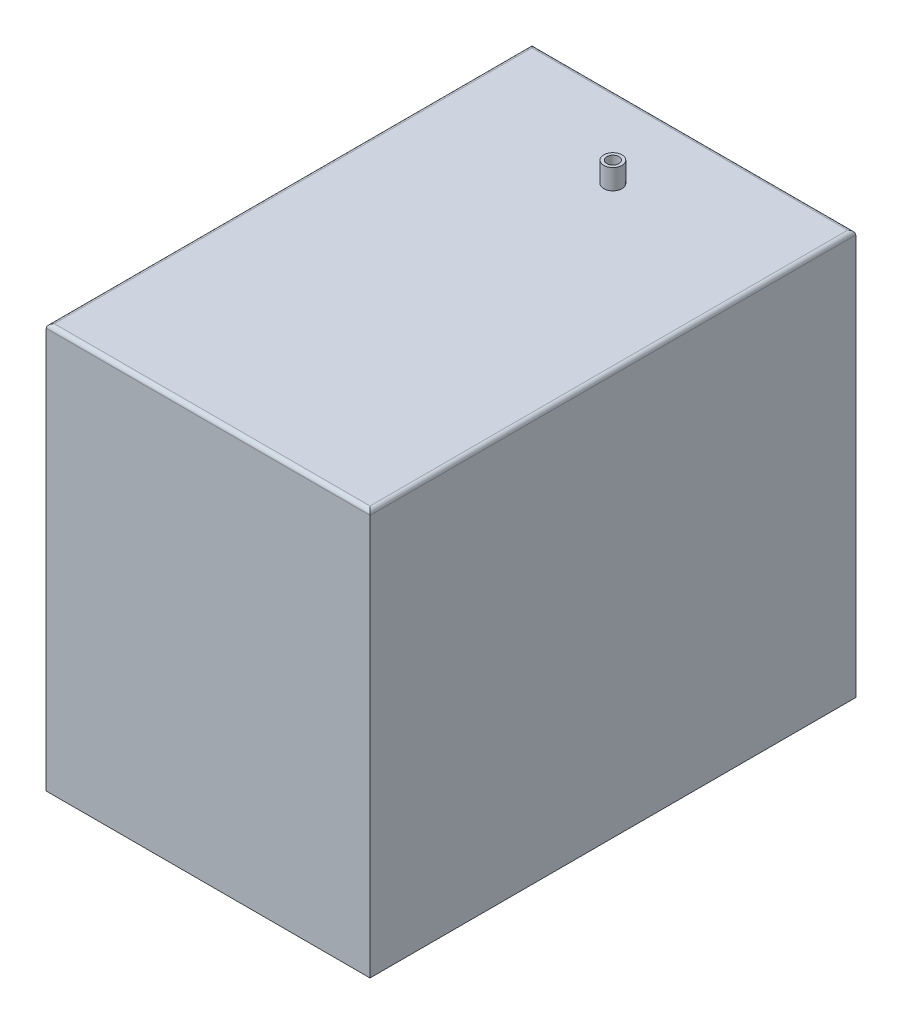
ISO-10303-21;
HEADER;
FILE_DESCRIPTION(('STEP AP214'),'2;1');
FILE_NAME('part.step','',(''),(''),'','','');
FILE_SCHEMA(('AUTOMOTIVE_DESIGN { 1 0 10303 214 1 1 1 1 }'));
ENDSEC;
DATA;
#1=APPLICATION_CONTEXT('core data for automotive mechanical design processes');
#2=APPLICATION_PROTOCOL_DEFINITION('international standard','automotive_design',2000,#1);
#3=PRODUCT_CONTEXT('',#1,'mechanical');
#4=PRODUCT('Part','Part','',(#3));
#5=PRODUCT_RELATED_PRODUCT_CATEGORY('part','',(#4));
#6=PRODUCT_DEFINITION_FORMATION('','',#4);
#7=PRODUCT_DEFINITION_CONTEXT('part definition',#1,'design');
#8=PRODUCT_DEFINITION('design','',#6,#7);
#9=PRODUCT_DEFINITION_SHAPE('','',#8);
#10=(LENGTH_UNIT() NAMED_UNIT(*) SI_UNIT(.MILLI.,.METRE.));
#11=(NAMED_UNIT(*) PLANE_ANGLE_UNIT() SI_UNIT($,.RADIAN.));
#12=(NAMED_UNIT(*) SI_UNIT($,.STERADIAN.) SOLID_ANGLE_UNIT());
#13=UNCERTAINTY_MEASURE_WITH_UNIT(LENGTH_MEASURE(1.E-05),#10,'distance_accuracy_value','');
#14=(GEOMETRIC_REPRESENTATION_CONTEXT(3) GLOBAL_UNCERTAINTY_ASSIGNED_CONTEXT((#13)) GLOBAL_UNIT_ASSIGNED_CONTEXT((#10,
#11,#12)) REPRESENTATION_CONTEXT('',''));
#15=CARTESIAN_POINT('',(0.,0.,0.));
#16=DIRECTION('',(0.,0.,1.));
#17=DIRECTION('',(1.,0.,0.));
#18=AXIS2_PLACEMENT_3D('',#15,#16,#17);
#19=CARTESIAN_POINT('',(40.,100.,-60.));
#20=DIRECTION('',(-1.,0.,0.));
#21=DIRECTION('',(0.,0.,1.));
#22=AXIS2_PLACEMENT_3D('',#19,#20,#21);
#23=PLANE('',#22);
#24=DIRECTION('',(0.,-1.,0.));
#25=VECTOR('',#24,1.);
#26=CARTESIAN_POINT('',(40.,100.,-60.));
#27=LINE('',#26,#25);
#28=CARTESIAN_POINT('',(40.,99.,-60.));
#29=VERTEX_POINT('',#28);
#30=CARTESIAN_POINT('',(40.,0.,-60.));
#31=VERTEX_POINT('',#30);
#32=EDGE_CURVE('E96',#29,#31,#27,.T.);
#33=ORIENTED_EDGE('',*,*,#32,.F.);
#34=DIRECTION('',(0.,0.,-1.));
#35=VECTOR('',#34,1.);
#36=CARTESIAN_POINT('',(40.,99.,60.));
#37=LINE('',#36,#35);
#38=CARTESIAN_POINT('',(40.,99.,60.));
#39=VERTEX_POINT('',#38);
#40=EDGE_CURVE('E65',#29,#39,#37,.F.);
#41=ORIENTED_EDGE('',*,*,#40,.T.);
#42=DIRECTION('',(0.,-1.,0.));
#43=VECTOR('',#42,1.);
#44=CARTESIAN_POINT('',(40.,100.,60.));
#45=LINE('',#44,#43);
#46=CARTESIAN_POINT('',(40.,0.,60.));
#47=VERTEX_POINT('',#46);
#48=EDGE_CURVE('E118',#39,#47,#45,.T.);
#49=ORIENTED_EDGE('',*,*,#48,.T.);
#50=DIRECTION('',(0.,0.,-1.));
#51=VECTOR('',#50,1.);
#52=CARTESIAN_POINT('',(40.,0.,-60.));
#53=LINE('',#52,#51);
#54=EDGE_CURVE('E113',#47,#31,#53,.T.);
#55=ORIENTED_EDGE('',*,*,#54,.T.);
#56=EDGE_LOOP('',(#33,#41,#49,#55));
#57=FACE_BOUND('',#56,.T.);
#58=ADVANCED_FACE('F41',(#57),#23,.F.);
#59=CARTESIAN_POINT('',(-40.,100.,-60.));
#60=DIRECTION('',(0.,0.,1.));
#61=DIRECTION('',(1.,0.,0.));
#62=AXIS2_PLACEMENT_3D('',#59,#60,#61);
#63=PLANE('',#62);
#64=DIRECTION('',(0.,-1.,0.));
#65=VECTOR('',#64,1.);
#66=CARTESIAN_POINT('',(-40.,100.,-60.));
#67=LINE('',#66,#65);
#68=CARTESIAN_POINT('',(-40.,99.,-60.));
#69=VERTEX_POINT('',#68);
#70=CARTESIAN_POINT('',(-40.,0.,-60.));
#71=VERTEX_POINT('',#70);
#72=EDGE_CURVE('E107',#69,#71,#67,.T.);
#73=ORIENTED_EDGE('',*,*,#72,.F.);
#74=DIRECTION('',(-1.,0.,0.));
#75=VECTOR('',#74,1.);
#76=CARTESIAN_POINT('',(40.,99.,-60.));
#77=LINE('',#76,#75);
#78=EDGE_CURVE('E103',#69,#29,#77,.F.);
#79=ORIENTED_EDGE('',*,*,#78,.T.);
#80=ORIENTED_EDGE('',*,*,#32,.T.);
#81=DIRECTION('',(-1.,0.,0.));
#82=VECTOR('',#81,1.);
#83=CARTESIAN_POINT('',(-40.,0.,-60.));
#84=LINE('',#83,#82);
#85=EDGE_CURVE('E100',#31,#71,#84,.T.);
#86=ORIENTED_EDGE('',*,*,#85,.T.);
#87=EDGE_LOOP('',(#73,#79,#80,#86));
#88=FACE_BOUND('',#87,.T.);
#89=ADVANCED_FACE('F99',(#88),#63,.F.);
#90=CARTESIAN_POINT('',(-40.,100.,-60.));
#91=DIRECTION('',(1.,0.,0.));
#92=DIRECTION('',(0.,0.,-1.));
#93=AXIS2_PLACEMENT_3D('',#90,#91,#92);
#94=PLANE('',#93);
#95=DIRECTION('',(0.,-1.,0.));
#96=VECTOR('',#95,1.);
#97=CARTESIAN_POINT('',(-40.,100.,60.));
#98=LINE('',#97,#96);
#99=CARTESIAN_POINT('',(-40.,99.,60.));
#100=VERTEX_POINT('',#99);
#101=CARTESIAN_POINT('',(-40.,0.,60.));
#102=VERTEX_POINT('',#101);
#103=EDGE_CURVE('E136',#100,#102,#98,.T.);
#104=ORIENTED_EDGE('',*,*,#103,.F.);
#105=DIRECTION('',(0.,0.,1.));
#106=VECTOR('',#105,1.);
#107=CARTESIAN_POINT('',(-40.,99.,-60.));
#108=LINE('',#107,#106);
#109=EDGE_CURVE('E51',#100,#69,#108,.F.);
#110=ORIENTED_EDGE('',*,*,#109,.T.);
#111=ORIENTED_EDGE('',*,*,#72,.T.);
#112=DIRECTION('',(0.,0.,1.));
#113=VECTOR('',#112,1.);
#114=CARTESIAN_POINT('',(-40.,0.,-60.));
#115=LINE('',#114,#113);
#116=EDGE_CURVE('E115',#71,#102,#115,.T.);
#117=ORIENTED_EDGE('',*,*,#116,.T.);
#118=EDGE_LOOP('',(#104,#110,#111,#117));
#119=FACE_BOUND('',#118,.T.);
#120=ADVANCED_FACE('F204',(#119),#94,.F.);
#121=CARTESIAN_POINT('',(-40.,100.,60.));
#122=DIRECTION('',(0.,0.,-1.));
#123=DIRECTION('',(-1.,0.,0.));
#124=AXIS2_PLACEMENT_3D('',#121,#122,#123);
#125=PLANE('',#124);
#126=ORIENTED_EDGE('',*,*,#48,.F.);
#127=DIRECTION('',(1.,0.,0.));
#128=VECTOR('',#127,1.);
#129=CARTESIAN_POINT('',(-40.,99.,60.));
#130=LINE('',#129,#128);
#131=EDGE_CURVE('E11',#39,#100,#130,.F.);
#132=ORIENTED_EDGE('',*,*,#131,.T.);
#133=ORIENTED_EDGE('',*,*,#103,.T.);
#134=DIRECTION('',(1.,0.,0.));
#135=VECTOR('',#134,1.);
#136=CARTESIAN_POINT('',(-40.,0.,60.));
#137=LINE('',#136,#135);
#138=EDGE_CURVE('E131',#102,#47,#137,.T.);
#139=ORIENTED_EDGE('',*,*,#138,.T.);
#140=EDGE_LOOP('',(#126,#132,#133,#139));
#141=FACE_BOUND('',#140,.T.);
#142=ADVANCED_FACE('F194',(#141),#125,.F.);
#143=CARTESIAN_POINT('',(0.,100.,0.));
#144=DIRECTION('',(0.,1.,0.));
#145=DIRECTION('',(0.,0.,1.));
#146=AXIS2_PLACEMENT_3D('',#143,#144,#145);
#147=PLANE('',#146);
#148=DIRECTION('',(0.,0.,-1.));
#149=VECTOR('',#148,1.);
#150=CARTESIAN_POINT('',(39.,100.,-60.));
#151=LINE('',#150,#149);
#152=CARTESIAN_POINT('',(39.,100.,59.));
#153=VERTEX_POINT('',#152);
#154=CARTESIAN_POINT('',(39.,100.,-59.));
#155=VERTEX_POINT('',#154);
#156=EDGE_CURVE('E150',#153,#155,#151,.T.);
#157=ORIENTED_EDGE('',*,*,#156,.T.);
#158=DIRECTION('',(-1.,0.,0.));
#159=VECTOR('',#158,1.);
#160=CARTESIAN_POINT('',(-40.,100.,-59.));
#161=LINE('',#160,#159);
#162=CARTESIAN_POINT('',(-39.,100.,-59.));
#163=VERTEX_POINT('',#162);
#164=EDGE_CURVE('E153',#155,#163,#161,.T.);
#165=ORIENTED_EDGE('',*,*,#164,.T.);
#166=DIRECTION('',(0.,0.,1.));
#167=VECTOR('',#166,1.);
#168=CARTESIAN_POINT('',(-39.,100.,60.));
#169=LINE('',#168,#167);
#170=CARTESIAN_POINT('',(-39.,100.,59.));
#171=VERTEX_POINT('',#170);
#172=EDGE_CURVE('E147',#163,#171,#169,.T.);
#173=ORIENTED_EDGE('',*,*,#172,.T.);
#174=DIRECTION('',(1.,0.,0.));
#175=VECTOR('',#174,1.);
#176=CARTESIAN_POINT('',(40.,100.,59.));
#177=LINE('',#176,#175);
#178=EDGE_CURVE('E144',#171,#153,#177,.T.);
#179=ORIENTED_EDGE('',*,*,#178,.T.);
#180=EDGE_LOOP('',(#157,#165,#173,#179));
#181=FACE_BOUND('',#180,.T.);
#182=CARTESIAN_POINT('',(0.,100.,-40.));
#183=DIRECTION('',(0.,1.,0.));
#184=DIRECTION('',(0.,0.,1.));
#185=AXIS2_PLACEMENT_3D('',#182,#183,#184);
#186=CIRCLE('',#185,2.25);
#187=CARTESIAN_POINT('',(0.,100.,-37.75));
#188=VERTEX_POINT('',#187);
#189=EDGE_CURVE('E125',#188,#188,#186,.T.);
#190=ORIENTED_EDGE('',*,*,#189,.F.);
#191=EDGE_LOOP('',(#190));
#192=FACE_BOUND('',#191,.T.);
#193=ADVANCED_FACE('F192',(#181,#192),#147,.T.);
#194=CARTESIAN_POINT('',(0.,0.,0.));
#195=DIRECTION('',(0.,1.,0.));
#196=DIRECTION('',(0.,0.,1.));
#197=AXIS2_PLACEMENT_3D('',#194,#195,#196);
#198=PLANE('',#197);
#199=ORIENTED_EDGE('',*,*,#54,.F.);
#200=ORIENTED_EDGE('',*,*,#138,.F.);
#201=ORIENTED_EDGE('',*,*,#116,.F.);
#202=ORIENTED_EDGE('',*,*,#85,.F.);
#203=EDGE_LOOP('',(#199,#200,#201,#202));
#204=FACE_BOUND('',#203,.T.);
#205=ADVANCED_FACE('F111',(#204),#198,.F.);
#206=CARTESIAN_POINT('',(0.,105.,-40.));
#207=DIRECTION('',(0.,1.,0.));
#208=DIRECTION('',(0.,0.,1.));
#209=AXIS2_PLACEMENT_3D('',#206,#207,#208);
#210=PLANE('',#209);
#211=CARTESIAN_POINT('',(0.,105.,-40.));
#212=DIRECTION('',(0.,1.,0.));
#213=DIRECTION('',(0.,0.,1.));
#214=AXIS2_PLACEMENT_3D('',#211,#212,#213);
#215=CIRCLE('',#214,2.25);
#216=CARTESIAN_POINT('',(0.,105.,-37.75));
#217=VERTEX_POINT('',#216);
#218=EDGE_CURVE('E121',#217,#217,#215,.T.);
#219=ORIENTED_EDGE('',*,*,#218,.T.);
#220=EDGE_LOOP('',(#219));
#221=FACE_BOUND('',#220,.T.);
#222=CARTESIAN_POINT('',(0.,105.,-40.));
#223=DIRECTION('',(0.,1.,0.));
#224=DIRECTION('',(0.,0.,1.));
#225=AXIS2_PLACEMENT_3D('',#222,#223,#224);
#226=CIRCLE('',#225,1.5);
#227=CARTESIAN_POINT('',(0.,105.,-38.5));
#228=VERTEX_POINT('',#227);
#229=EDGE_CURVE('E177',#228,#228,#226,.T.);
#230=ORIENTED_EDGE('',*,*,#229,.F.);
#231=EDGE_LOOP('',(#230));
#232=FACE_BOUND('',#231,.T.);
#233=ADVANCED_FACE('F202',(#221,#232),#210,.T.);
#234=CARTESIAN_POINT('',(0.,105.,-40.));
#235=DIRECTION('',(0.,-1.,0.));
#236=DIRECTION('',(0.,0.,-1.));
#237=AXIS2_PLACEMENT_3D('',#234,#235,#236);
#238=CYLINDRICAL_SURFACE('',#237,2.25);
#239=ORIENTED_EDGE('',*,*,#218,.F.);
#240=EDGE_LOOP('',(#239));
#241=FACE_BOUND('',#240,.T.);
#242=ORIENTED_EDGE('',*,*,#189,.T.);
#243=EDGE_LOOP('',(#242));
#244=FACE_BOUND('',#243,.T.);
#245=ADVANCED_FACE('F190',(#241,#244),#238,.T.);
#246=CARTESIAN_POINT('',(0.,105.,-40.));
#247=DIRECTION('',(0.,-1.,0.));
#248=DIRECTION('',(0.,0.,-1.));
#249=AXIS2_PLACEMENT_3D('',#246,#247,#248);
#250=CYLINDRICAL_SURFACE('',#249,1.5);
#251=ORIENTED_EDGE('',*,*,#229,.T.);
#252=EDGE_LOOP('',(#251));
#253=FACE_BOUND('',#252,.T.);
#254=CARTESIAN_POINT('',(0.,100.,-40.));
#255=DIRECTION('',(0.,1.,0.));
#256=DIRECTION('',(0.,0.,1.));
#257=AXIS2_PLACEMENT_3D('',#254,#255,#256);
#258=CIRCLE('',#257,1.5);
#259=CARTESIAN_POINT('',(0.,100.,-38.5));
#260=VERTEX_POINT('',#259);
#261=EDGE_CURVE('E106',#260,#260,#258,.F.);
#262=ORIENTED_EDGE('',*,*,#261,.T.);
#263=EDGE_LOOP('',(#262));
#264=FACE_BOUND('',#263,.T.);
#265=ADVANCED_FACE('F208',(#253,#264),#250,.F.);
#266=ORIENTED_EDGE('',*,*,#261,.F.);
#267=EDGE_LOOP('',(#266));
#268=FACE_BOUND('',#267,.T.);
#269=ADVANCED_FACE('F197',(#268),#147,.T.);
#270=CARTESIAN_POINT('',(0.,99.,59.));
#271=DIRECTION('',(-1.,0.,0.));
#272=DIRECTION('',(0.,0.,1.));
#273=AXIS2_PLACEMENT_3D('',#270,#271,#272);
#274=CYLINDRICAL_SURFACE('',#273,1.);
#275=CARTESIAN_POINT('',(-39.,99.,59.));
#276=DIRECTION('',(-0.707106781186548,0.,-0.707106781186547));
#277=DIRECTION('',(-0.707106781186547,0.,0.707106781186548));
#278=AXIS2_PLACEMENT_3D('',#275,#276,#277);
#279=ELLIPSE('',#278,1.41421356237309,1.);
#280=EDGE_CURVE('E168',#100,#171,#279,.T.);
#281=ORIENTED_EDGE('',*,*,#280,.F.);
#282=ORIENTED_EDGE('',*,*,#131,.F.);
#283=CARTESIAN_POINT('',(39.,99.,59.));
#284=DIRECTION('',(-0.707106781186547,0.,0.707106781186548));
#285=DIRECTION('',(-0.707106781186548,0.,-0.707106781186547));
#286=AXIS2_PLACEMENT_3D('',#283,#284,#285);
#287=ELLIPSE('',#286,1.4142135623731,1.);
#288=EDGE_CURVE('E45',#153,#39,#287,.F.);
#289=ORIENTED_EDGE('',*,*,#288,.F.);
#290=ORIENTED_EDGE('',*,*,#178,.F.);
#291=EDGE_LOOP('',(#281,#282,#289,#290));
#292=FACE_BOUND('',#291,.T.);
#293=ADVANCED_FACE('F43',(#292),#274,.T.);
#294=CARTESIAN_POINT('',(39.,99.,0.));
#295=DIRECTION('',(0.,0.,1.));
#296=DIRECTION('',(1.,0.,0.));
#297=AXIS2_PLACEMENT_3D('',#294,#295,#296);
#298=CYLINDRICAL_SURFACE('',#297,1.);
#299=ORIENTED_EDGE('',*,*,#288,.T.);
#300=ORIENTED_EDGE('',*,*,#40,.F.);
#301=CARTESIAN_POINT('',(39.,99.,-59.));
#302=DIRECTION('',(0.707106781186548,0.,0.707106781186547));
#303=DIRECTION('',(-0.707106781186547,0.,0.707106781186548));
#304=AXIS2_PLACEMENT_3D('',#301,#302,#303);
#305=ELLIPSE('',#304,1.41421356237309,1.);
#306=EDGE_CURVE('E166',#155,#29,#305,.F.);
#307=ORIENTED_EDGE('',*,*,#306,.F.);
#308=ORIENTED_EDGE('',*,*,#156,.F.);
#309=EDGE_LOOP('',(#299,#300,#307,#308));
#310=FACE_BOUND('',#309,.T.);
#311=ADVANCED_FACE('F224',(#310),#298,.T.);
#312=CARTESIAN_POINT('',(-39.,99.,0.));
#313=DIRECTION('',(0.,0.,-1.));
#314=DIRECTION('',(-1.,0.,0.));
#315=AXIS2_PLACEMENT_3D('',#312,#313,#314);
#316=CYLINDRICAL_SURFACE('',#315,1.);
#317=ORIENTED_EDGE('',*,*,#280,.T.);
#318=ORIENTED_EDGE('',*,*,#172,.F.);
#319=CARTESIAN_POINT('',(-39.,99.,-59.));
#320=DIRECTION('',(0.707106781186547,0.,-0.707106781186548));
#321=DIRECTION('',(-0.707106781186548,0.,-0.707106781186547));
#322=AXIS2_PLACEMENT_3D('',#319,#320,#321);
#323=ELLIPSE('',#322,1.4142135623731,1.);
#324=EDGE_CURVE('E163',#69,#163,#323,.T.);
#325=ORIENTED_EDGE('',*,*,#324,.F.);
#326=ORIENTED_EDGE('',*,*,#109,.F.);
#327=EDGE_LOOP('',(#317,#318,#325,#326));
#328=FACE_BOUND('',#327,.T.);
#329=ADVANCED_FACE('F221',(#328),#316,.T.);
#330=CARTESIAN_POINT('',(0.,99.,-59.));
#331=DIRECTION('',(1.,0.,0.));
#332=DIRECTION('',(0.,0.,-1.));
#333=AXIS2_PLACEMENT_3D('',#330,#331,#332);
#334=CYLINDRICAL_SURFACE('',#333,1.);
#335=ORIENTED_EDGE('',*,*,#306,.T.);
#336=ORIENTED_EDGE('',*,*,#78,.F.);
#337=ORIENTED_EDGE('',*,*,#324,.T.);
#338=ORIENTED_EDGE('',*,*,#164,.F.);
#339=EDGE_LOOP('',(#335,#336,#337,#338));
#340=FACE_BOUND('',#339,.T.);
#341=ADVANCED_FACE('F218',(#340),#334,.T.);
#342=CLOSED_SHELL('',(#58,#89,#120,#142,#193,#205,#233,#245,#265,#269,#293,#311,#329,#341));
#343=MANIFOLD_SOLID_BREP('B2',#342);
#344=ADVANCED_BREP_SHAPE_REPRESENTATION('',(#18,#343),#14);
#345=SHAPE_DEFINITION_REPRESENTATION(#9,#344);
ENDSEC;
END-ISO-10303-21;
